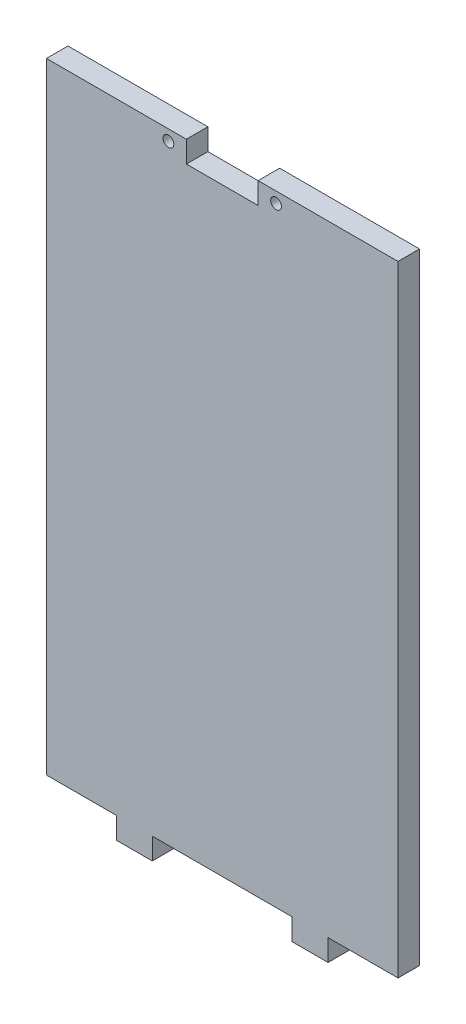
ISO-10303-21;
HEADER;
FILE_DESCRIPTION(('STEP AP214'),'2;1');
FILE_NAME('part.step','',(''),(''),'','','');
FILE_SCHEMA(('AUTOMOTIVE_DESIGN { 1 0 10303 214 1 1 1 1 }'));
ENDSEC;
DATA;
#1=APPLICATION_CONTEXT('core data for automotive mechanical design processes');
#2=APPLICATION_PROTOCOL_DEFINITION('international standard','automotive_design',2000,#1);
#3=PRODUCT_CONTEXT('',#1,'mechanical');
#4=PRODUCT('Part','Part','',(#3));
#5=PRODUCT_RELATED_PRODUCT_CATEGORY('part','',(#4));
#6=PRODUCT_DEFINITION_FORMATION('','',#4);
#7=PRODUCT_DEFINITION_CONTEXT('part definition',#1,'design');
#8=PRODUCT_DEFINITION('design','',#6,#7);
#9=PRODUCT_DEFINITION_SHAPE('','',#8);
#10=(LENGTH_UNIT() NAMED_UNIT(*) SI_UNIT(.MILLI.,.METRE.));
#11=(NAMED_UNIT(*) PLANE_ANGLE_UNIT() SI_UNIT($,.RADIAN.));
#12=(NAMED_UNIT(*) SI_UNIT($,.STERADIAN.) SOLID_ANGLE_UNIT());
#13=UNCERTAINTY_MEASURE_WITH_UNIT(LENGTH_MEASURE(1.E-05),#10,'distance_accuracy_value','');
#14=(GEOMETRIC_REPRESENTATION_CONTEXT(3) GLOBAL_UNCERTAINTY_ASSIGNED_CONTEXT((#13)) GLOBAL_UNIT_ASSIGNED_CONTEXT((#10,
#11,#12)) REPRESENTATION_CONTEXT('',''));
#15=CARTESIAN_POINT('',(0.,0.,0.));
#16=DIRECTION('',(0.,0.,1.));
#17=DIRECTION('',(1.,0.,0.));
#18=AXIS2_PLACEMENT_3D('',#15,#16,#17);
#19=CARTESIAN_POINT('',(-49.,86.4999999999999,6.));
#20=DIRECTION('',(0.,-1.,0.));
#21=DIRECTION('',(0.,0.,-1.));
#22=AXIS2_PLACEMENT_3D('',#19,#20,#21);
#23=PLANE('',#22);
#24=DIRECTION('',(-1.,0.,0.));
#25=VECTOR('',#24,1.);
#26=CARTESIAN_POINT('',(-49.,86.4999999999999,6.));
#27=LINE('',#26,#25);
#28=CARTESIAN_POINT('',(-9.99999999999997,86.4999999999999,6.));
#29=VERTEX_POINT('',#28);
#30=CARTESIAN_POINT('',(-49.,86.4999999999999,6.));
#31=VERTEX_POINT('',#30);
#32=EDGE_CURVE('E309',#29,#31,#27,.T.);
#33=ORIENTED_EDGE('',*,*,#32,.F.);
#34=DIRECTION('',(0.,0.,1.));
#35=VECTOR('',#34,1.);
#36=CARTESIAN_POINT('',(-9.99999999999997,86.4999999999999,0.));
#37=LINE('',#36,#35);
#38=CARTESIAN_POINT('',(-9.99999999999997,86.4999999999999,0.));
#39=VERTEX_POINT('',#38);
#40=EDGE_CURVE('E183',#39,#29,#37,.T.);
#41=ORIENTED_EDGE('',*,*,#40,.F.);
#42=DIRECTION('',(-1.,0.,0.));
#43=VECTOR('',#42,1.);
#44=CARTESIAN_POINT('',(-49.,86.4999999999999,0.));
#45=LINE('',#44,#43);
#46=CARTESIAN_POINT('',(-49.,86.4999999999999,0.));
#47=VERTEX_POINT('',#46);
#48=EDGE_CURVE('E174',#39,#47,#45,.T.);
#49=ORIENTED_EDGE('',*,*,#48,.T.);
#50=DIRECTION('',(0.,0.,-1.));
#51=VECTOR('',#50,1.);
#52=CARTESIAN_POINT('',(-49.,86.4999999999999,6.));
#53=LINE('',#52,#51);
#54=EDGE_CURVE('E285',#31,#47,#53,.T.);
#55=ORIENTED_EDGE('',*,*,#54,.F.);
#56=EDGE_LOOP('',(#33,#41,#49,#55));
#57=FACE_BOUND('',#56,.T.);
#58=ADVANCED_FACE('F37',(#57),#23,.F.);
#59=CARTESIAN_POINT('',(-49.,-86.5,6.));
#60=DIRECTION('',(0.,1.,0.));
#61=DIRECTION('',(0.,0.,1.));
#62=AXIS2_PLACEMENT_3D('',#59,#60,#61);
#63=PLANE('',#62);
#64=DIRECTION('',(1.,0.,0.));
#65=VECTOR('',#64,1.);
#66=CARTESIAN_POINT('',(-49.,-86.5,6.));
#67=LINE('',#66,#65);
#68=CARTESIAN_POINT('',(-19.5,-86.5,6.));
#69=VERTEX_POINT('',#68);
#70=CARTESIAN_POINT('',(19.5,-86.5,6.));
#71=VERTEX_POINT('',#70);
#72=EDGE_CURVE('E41',#69,#71,#67,.T.);
#73=ORIENTED_EDGE('',*,*,#72,.F.);
#74=DIRECTION('',(0.,0.,1.));
#75=VECTOR('',#74,1.);
#76=CARTESIAN_POINT('',(-19.5,-86.5,0.));
#77=LINE('',#76,#75);
#78=CARTESIAN_POINT('',(-19.5,-86.5,0.));
#79=VERTEX_POINT('',#78);
#80=EDGE_CURVE('E212',#79,#69,#77,.T.);
#81=ORIENTED_EDGE('',*,*,#80,.F.);
#82=DIRECTION('',(1.,0.,0.));
#83=VECTOR('',#82,1.);
#84=CARTESIAN_POINT('',(-49.,-86.5,0.));
#85=LINE('',#84,#83);
#86=CARTESIAN_POINT('',(19.5,-86.5,0.));
#87=VERTEX_POINT('',#86);
#88=EDGE_CURVE('E264',#79,#87,#85,.T.);
#89=ORIENTED_EDGE('',*,*,#88,.T.);
#90=DIRECTION('',(0.,0.,1.));
#91=VECTOR('',#90,1.);
#92=CARTESIAN_POINT('',(19.5,-86.5,0.));
#93=LINE('',#92,#91);
#94=EDGE_CURVE('E243',#87,#71,#93,.T.);
#95=ORIENTED_EDGE('',*,*,#94,.T.);
#96=EDGE_LOOP('',(#73,#81,#89,#95));
#97=FACE_BOUND('',#96,.T.);
#98=ADVANCED_FACE('F340',(#97),#63,.F.);
#99=DIRECTION('',(0.,0.,1.));
#100=VECTOR('',#99,1.);
#101=CARTESIAN_POINT('',(29.5,-86.5,0.));
#102=LINE('',#101,#100);
#103=CARTESIAN_POINT('',(29.5,-86.5,0.));
#104=VERTEX_POINT('',#103);
#105=CARTESIAN_POINT('',(29.5,-86.5,6.));
#106=VERTEX_POINT('',#105);
#107=EDGE_CURVE('E231',#104,#106,#102,.T.);
#108=ORIENTED_EDGE('',*,*,#107,.F.);
#109=CARTESIAN_POINT('',(49.,-86.5,0.));
#110=VERTEX_POINT('',#109);
#111=EDGE_CURVE('E267',#104,#110,#85,.T.);
#112=ORIENTED_EDGE('',*,*,#111,.T.);
#113=DIRECTION('',(0.,0.,-1.));
#114=VECTOR('',#113,1.);
#115=CARTESIAN_POINT('',(49.,-86.5,6.));
#116=LINE('',#115,#114);
#117=CARTESIAN_POINT('',(49.,-86.5,6.));
#118=VERTEX_POINT('',#117);
#119=EDGE_CURVE('E47',#118,#110,#116,.T.);
#120=ORIENTED_EDGE('',*,*,#119,.F.);
#121=EDGE_CURVE('E294',#106,#118,#67,.T.);
#122=ORIENTED_EDGE('',*,*,#121,.F.);
#123=EDGE_LOOP('',(#108,#112,#120,#122));
#124=FACE_BOUND('',#123,.T.);
#125=ADVANCED_FACE('F327',(#124),#63,.F.);
#126=CARTESIAN_POINT('',(-49.,86.4999999999999,6.));
#127=DIRECTION('',(1.,0.,0.));
#128=DIRECTION('',(0.,1.,0.));
#129=AXIS2_PLACEMENT_3D('',#126,#127,#128);
#130=PLANE('',#129);
#131=DIRECTION('',(0.,-1.,0.));
#132=VECTOR('',#131,1.);
#133=CARTESIAN_POINT('',(-49.,86.4999999999999,0.));
#134=LINE('',#133,#132);
#135=CARTESIAN_POINT('',(-49.,-86.5,0.));
#136=VERTEX_POINT('',#135);
#137=EDGE_CURVE('E240',#47,#136,#134,.T.);
#138=ORIENTED_EDGE('',*,*,#137,.T.);
#139=DIRECTION('',(0.,0.,-1.));
#140=VECTOR('',#139,1.);
#141=CARTESIAN_POINT('',(-49.,-86.5,6.));
#142=LINE('',#141,#140);
#143=CARTESIAN_POINT('',(-49.,-86.5,6.));
#144=VERTEX_POINT('',#143);
#145=EDGE_CURVE('E11',#144,#136,#142,.T.);
#146=ORIENTED_EDGE('',*,*,#145,.F.);
#147=DIRECTION('',(0.,-1.,0.));
#148=VECTOR('',#147,1.);
#149=CARTESIAN_POINT('',(-49.,86.4999999999999,6.));
#150=LINE('',#149,#148);
#151=EDGE_CURVE('E290',#31,#144,#150,.T.);
#152=ORIENTED_EDGE('',*,*,#151,.F.);
#153=ORIENTED_EDGE('',*,*,#54,.T.);
#154=EDGE_LOOP('',(#138,#146,#152,#153));
#155=FACE_BOUND('',#154,.T.);
#156=ADVANCED_FACE('F39',(#155),#130,.F.);
#157=CARTESIAN_POINT('',(-29.5,-86.5,0.));
#158=VERTEX_POINT('',#157);
#159=EDGE_CURVE('E266',#136,#158,#85,.T.);
#160=ORIENTED_EDGE('',*,*,#159,.T.);
#161=DIRECTION('',(0.,0.,1.));
#162=VECTOR('',#161,1.);
#163=CARTESIAN_POINT('',(-29.5,-86.5,0.));
#164=LINE('',#163,#162);
#165=CARTESIAN_POINT('',(-29.5,-86.5,6.));
#166=VERTEX_POINT('',#165);
#167=EDGE_CURVE('E225',#158,#166,#164,.T.);
#168=ORIENTED_EDGE('',*,*,#167,.T.);
#169=EDGE_CURVE('E312',#144,#166,#67,.T.);
#170=ORIENTED_EDGE('',*,*,#169,.F.);
#171=ORIENTED_EDGE('',*,*,#145,.T.);
#172=EDGE_LOOP('',(#160,#168,#170,#171));
#173=FACE_BOUND('',#172,.T.);
#174=ADVANCED_FACE('F337',(#173),#63,.F.);
#175=CARTESIAN_POINT('',(49.,86.4999999999999,6.));
#176=DIRECTION('',(-1.,0.,0.));
#177=DIRECTION('',(0.,-1.,0.));
#178=AXIS2_PLACEMENT_3D('',#175,#176,#177);
#179=PLANE('',#178);
#180=DIRECTION('',(0.,1.,0.));
#181=VECTOR('',#180,1.);
#182=CARTESIAN_POINT('',(49.,86.4999999999999,0.));
#183=LINE('',#182,#181);
#184=CARTESIAN_POINT('',(49.,86.4999999999999,0.));
#185=VERTEX_POINT('',#184);
#186=EDGE_CURVE('E272',#110,#185,#183,.T.);
#187=ORIENTED_EDGE('',*,*,#186,.T.);
#188=DIRECTION('',(0.,0.,-1.));
#189=VECTOR('',#188,1.);
#190=CARTESIAN_POINT('',(49.,86.4999999999999,6.));
#191=LINE('',#190,#189);
#192=CARTESIAN_POINT('',(49.,86.4999999999999,6.));
#193=VERTEX_POINT('',#192);
#194=EDGE_CURVE('E282',#193,#185,#191,.T.);
#195=ORIENTED_EDGE('',*,*,#194,.F.);
#196=DIRECTION('',(0.,1.,0.));
#197=VECTOR('',#196,1.);
#198=CARTESIAN_POINT('',(49.,86.4999999999999,6.));
#199=LINE('',#198,#197);
#200=EDGE_CURVE('E310',#118,#193,#199,.T.);
#201=ORIENTED_EDGE('',*,*,#200,.F.);
#202=ORIENTED_EDGE('',*,*,#119,.T.);
#203=EDGE_LOOP('',(#187,#195,#201,#202));
#204=FACE_BOUND('',#203,.T.);
#205=ADVANCED_FACE('F300',(#204),#179,.F.);
#206=CARTESIAN_POINT('',(10.,86.4999999999999,0.));
#207=VERTEX_POINT('',#206);
#208=EDGE_CURVE('E288',#185,#207,#45,.T.);
#209=ORIENTED_EDGE('',*,*,#208,.T.);
#210=DIRECTION('',(0.,0.,1.));
#211=VECTOR('',#210,1.);
#212=CARTESIAN_POINT('',(10.,86.4999999999999,0.));
#213=LINE('',#212,#211);
#214=CARTESIAN_POINT('',(10.,86.4999999999999,6.));
#215=VERTEX_POINT('',#214);
#216=EDGE_CURVE('E186',#207,#215,#213,.T.);
#217=ORIENTED_EDGE('',*,*,#216,.T.);
#218=EDGE_CURVE('E287',#193,#215,#27,.T.);
#219=ORIENTED_EDGE('',*,*,#218,.F.);
#220=ORIENTED_EDGE('',*,*,#194,.T.);
#221=EDGE_LOOP('',(#209,#217,#219,#220));
#222=FACE_BOUND('',#221,.T.);
#223=ADVANCED_FACE('F305',(#222),#23,.F.);
#224=CARTESIAN_POINT('',(0.,0.,6.));
#225=DIRECTION('',(0.,0.,1.));
#226=DIRECTION('',(1.,0.,0.));
#227=AXIS2_PLACEMENT_3D('',#224,#225,#226);
#228=PLANE('',#227);
#229=DIRECTION('',(0.,-1.,0.));
#230=VECTOR('',#229,1.);
#231=CARTESIAN_POINT('',(-9.99999999999997,86.4999999999999,6.));
#232=LINE('',#231,#230);
#233=CARTESIAN_POINT('',(-9.99999999999997,80.4999999999999,6.));
#234=VERTEX_POINT('',#233);
#235=EDGE_CURVE('E159',#29,#234,#232,.T.);
#236=ORIENTED_EDGE('',*,*,#235,.F.);
#237=ORIENTED_EDGE('',*,*,#32,.T.);
#238=ORIENTED_EDGE('',*,*,#151,.T.);
#239=ORIENTED_EDGE('',*,*,#169,.T.);
#240=DIRECTION('',(0.,-1.,0.));
#241=VECTOR('',#240,1.);
#242=CARTESIAN_POINT('',(-29.5,-86.5,6.));
#243=LINE('',#242,#241);
#244=CARTESIAN_POINT('',(-29.5,-92.5000000000001,6.));
#245=VERTEX_POINT('',#244);
#246=EDGE_CURVE('E215',#166,#245,#243,.T.);
#247=ORIENTED_EDGE('',*,*,#246,.T.);
#248=DIRECTION('',(1.,0.,0.));
#249=VECTOR('',#248,1.);
#250=CARTESIAN_POINT('',(-19.5,-92.5000000000001,6.));
#251=LINE('',#250,#249);
#252=CARTESIAN_POINT('',(-19.5,-92.5000000000001,6.));
#253=VERTEX_POINT('',#252);
#254=EDGE_CURVE('E206',#245,#253,#251,.T.);
#255=ORIENTED_EDGE('',*,*,#254,.T.);
#256=DIRECTION('',(0.,1.,0.));
#257=VECTOR('',#256,1.);
#258=CARTESIAN_POINT('',(-19.5,-86.5,6.));
#259=LINE('',#258,#257);
#260=EDGE_CURVE('E199',#253,#69,#259,.T.);
#261=ORIENTED_EDGE('',*,*,#260,.T.);
#262=ORIENTED_EDGE('',*,*,#72,.T.);
#263=DIRECTION('',(0.,-1.,0.));
#264=VECTOR('',#263,1.);
#265=CARTESIAN_POINT('',(19.5,-86.5,6.));
#266=LINE('',#265,#264);
#267=CARTESIAN_POINT('',(19.5,-92.5000000000001,6.));
#268=VERTEX_POINT('',#267);
#269=EDGE_CURVE('E237',#71,#268,#266,.T.);
#270=ORIENTED_EDGE('',*,*,#269,.T.);
#271=DIRECTION('',(1.,0.,0.));
#272=VECTOR('',#271,1.);
#273=CARTESIAN_POINT('',(29.5,-92.5000000000001,6.));
#274=LINE('',#273,#272);
#275=CARTESIAN_POINT('',(29.5,-92.5000000000001,6.));
#276=VERTEX_POINT('',#275);
#277=EDGE_CURVE('E233',#268,#276,#274,.T.);
#278=ORIENTED_EDGE('',*,*,#277,.T.);
#279=DIRECTION('',(0.,1.,0.));
#280=VECTOR('',#279,1.);
#281=CARTESIAN_POINT('',(29.5,-86.5,6.));
#282=LINE('',#281,#280);
#283=EDGE_CURVE('E222',#276,#106,#282,.T.);
#284=ORIENTED_EDGE('',*,*,#283,.T.);
#285=ORIENTED_EDGE('',*,*,#121,.T.);
#286=ORIENTED_EDGE('',*,*,#200,.T.);
#287=ORIENTED_EDGE('',*,*,#218,.T.);
#288=DIRECTION('',(0.,1.,0.));
#289=VECTOR('',#288,1.);
#290=CARTESIAN_POINT('',(10.,86.4999999999999,6.));
#291=LINE('',#290,#289);
#292=CARTESIAN_POINT('',(10.,80.4999999999999,6.));
#293=VERTEX_POINT('',#292);
#294=EDGE_CURVE('E175',#293,#215,#291,.T.);
#295=ORIENTED_EDGE('',*,*,#294,.F.);
#296=DIRECTION('',(1.,0.,0.));
#297=VECTOR('',#296,1.);
#298=CARTESIAN_POINT('',(-9.99999999999997,80.4999999999999,6.));
#299=LINE('',#298,#297);
#300=EDGE_CURVE('E177',#234,#293,#299,.T.);
#301=ORIENTED_EDGE('',*,*,#300,.F.);
#302=EDGE_LOOP('',(#236,#237,#238,#239,#247,#255,#261,#262,#270,#278,#284,#285,#286,#287,#295,#301));
#303=FACE_BOUND('',#302,.T.);
#304=CARTESIAN_POINT('',(15.,83.4999999999999,6.));
#305=DIRECTION('',(0.,0.,1.));
#306=DIRECTION('',(1.,0.,0.));
#307=AXIS2_PLACEMENT_3D('',#304,#305,#306);
#308=CIRCLE('',#307,1.5);
#309=CARTESIAN_POINT('',(16.5,83.4999999999999,6.));
#310=VERTEX_POINT('',#309);
#311=EDGE_CURVE('E185',#310,#310,#308,.T.);
#312=ORIENTED_EDGE('',*,*,#311,.F.);
#313=EDGE_LOOP('',(#312));
#314=FACE_BOUND('',#313,.T.);
#315=CARTESIAN_POINT('',(-15.,83.4999999999999,6.));
#316=DIRECTION('',(0.,0.,1.));
#317=DIRECTION('',(1.,0.,0.));
#318=AXIS2_PLACEMENT_3D('',#315,#316,#317);
#319=CIRCLE('',#318,1.5);
#320=CARTESIAN_POINT('',(-13.5,83.4999999999999,6.));
#321=VERTEX_POINT('',#320);
#322=EDGE_CURVE('E193',#321,#321,#319,.T.);
#323=ORIENTED_EDGE('',*,*,#322,.F.);
#324=EDGE_LOOP('',(#323));
#325=FACE_BOUND('',#324,.T.);
#326=ADVANCED_FACE('F322',(#303,#314,#325),#228,.T.);
#327=CARTESIAN_POINT('',(0.,0.,0.));
#328=DIRECTION('',(0.,0.,1.));
#329=DIRECTION('',(1.,0.,0.));
#330=AXIS2_PLACEMENT_3D('',#327,#328,#329);
#331=PLANE('',#330);
#332=ORIENTED_EDGE('',*,*,#48,.F.);
#333=DIRECTION('',(0.,-1.,0.));
#334=VECTOR('',#333,1.);
#335=CARTESIAN_POINT('',(-9.99999999999997,86.4999999999999,0.));
#336=LINE('',#335,#334);
#337=CARTESIAN_POINT('',(-9.99999999999997,80.4999999999999,0.));
#338=VERTEX_POINT('',#337);
#339=EDGE_CURVE('E156',#39,#338,#336,.T.);
#340=ORIENTED_EDGE('',*,*,#339,.T.);
#341=DIRECTION('',(1.,0.,0.));
#342=VECTOR('',#341,1.);
#343=CARTESIAN_POINT('',(-9.99999999999997,80.4999999999999,0.));
#344=LINE('',#343,#342);
#345=CARTESIAN_POINT('',(10.,80.4999999999999,0.));
#346=VERTEX_POINT('',#345);
#347=EDGE_CURVE('E166',#338,#346,#344,.T.);
#348=ORIENTED_EDGE('',*,*,#347,.T.);
#349=DIRECTION('',(0.,1.,0.));
#350=VECTOR('',#349,1.);
#351=CARTESIAN_POINT('',(10.,86.4999999999999,0.));
#352=LINE('',#351,#350);
#353=EDGE_CURVE('E55',#346,#207,#352,.T.);
#354=ORIENTED_EDGE('',*,*,#353,.T.);
#355=ORIENTED_EDGE('',*,*,#208,.F.);
#356=ORIENTED_EDGE('',*,*,#186,.F.);
#357=ORIENTED_EDGE('',*,*,#111,.F.);
#358=DIRECTION('',(0.,1.,0.));
#359=VECTOR('',#358,1.);
#360=CARTESIAN_POINT('',(29.5,-86.5,0.));
#361=LINE('',#360,#359);
#362=CARTESIAN_POINT('',(29.5,-92.5000000000001,0.));
#363=VERTEX_POINT('',#362);
#364=EDGE_CURVE('E236',#363,#104,#361,.T.);
#365=ORIENTED_EDGE('',*,*,#364,.F.);
#366=DIRECTION('',(1.,0.,0.));
#367=VECTOR('',#366,1.);
#368=CARTESIAN_POINT('',(29.5,-92.5000000000001,0.));
#369=LINE('',#368,#367);
#370=CARTESIAN_POINT('',(19.5,-92.5000000000001,0.));
#371=VERTEX_POINT('',#370);
#372=EDGE_CURVE('E228',#371,#363,#369,.T.);
#373=ORIENTED_EDGE('',*,*,#372,.F.);
#374=DIRECTION('',(0.,-1.,0.));
#375=VECTOR('',#374,1.);
#376=CARTESIAN_POINT('',(19.5,-86.5,0.));
#377=LINE('',#376,#375);
#378=EDGE_CURVE('E232',#87,#371,#377,.T.);
#379=ORIENTED_EDGE('',*,*,#378,.F.);
#380=ORIENTED_EDGE('',*,*,#88,.F.);
#381=DIRECTION('',(0.,1.,0.));
#382=VECTOR('',#381,1.);
#383=CARTESIAN_POINT('',(-19.5,-86.5,0.));
#384=LINE('',#383,#382);
#385=CARTESIAN_POINT('',(-19.5,-92.5000000000001,0.));
#386=VERTEX_POINT('',#385);
#387=EDGE_CURVE('E202',#386,#79,#384,.T.);
#388=ORIENTED_EDGE('',*,*,#387,.F.);
#389=DIRECTION('',(1.,0.,0.));
#390=VECTOR('',#389,1.);
#391=CARTESIAN_POINT('',(-19.5,-92.5000000000001,0.));
#392=LINE('',#391,#390);
#393=CARTESIAN_POINT('',(-29.5,-92.5000000000001,0.));
#394=VERTEX_POINT('',#393);
#395=EDGE_CURVE('E209',#394,#386,#392,.T.);
#396=ORIENTED_EDGE('',*,*,#395,.F.);
#397=DIRECTION('',(0.,-1.,0.));
#398=VECTOR('',#397,1.);
#399=CARTESIAN_POINT('',(-29.5,-86.5,0.));
#400=LINE('',#399,#398);
#401=EDGE_CURVE('E205',#158,#394,#400,.T.);
#402=ORIENTED_EDGE('',*,*,#401,.F.);
#403=ORIENTED_EDGE('',*,*,#159,.F.);
#404=ORIENTED_EDGE('',*,*,#137,.F.);
#405=EDGE_LOOP('',(#332,#340,#348,#354,#355,#356,#357,#365,#373,#379,#380,#388,#396,#402,#403,#404));
#406=FACE_BOUND('',#405,.T.);
#407=CARTESIAN_POINT('',(15.,83.4999999999999,0.));
#408=DIRECTION('',(0.,0.,1.));
#409=DIRECTION('',(1.,0.,0.));
#410=AXIS2_PLACEMENT_3D('',#407,#408,#409);
#411=CIRCLE('',#410,1.5);
#412=CARTESIAN_POINT('',(16.5,83.4999999999999,0.));
#413=VERTEX_POINT('',#412);
#414=EDGE_CURVE('E190',#413,#413,#411,.T.);
#415=ORIENTED_EDGE('',*,*,#414,.T.);
#416=EDGE_LOOP('',(#415));
#417=FACE_BOUND('',#416,.T.);
#418=CARTESIAN_POINT('',(-15.,83.4999999999999,0.));
#419=DIRECTION('',(0.,0.,1.));
#420=DIRECTION('',(1.,0.,0.));
#421=AXIS2_PLACEMENT_3D('',#418,#419,#420);
#422=CIRCLE('',#421,1.5);
#423=CARTESIAN_POINT('',(-13.5,83.4999999999999,0.));
#424=VERTEX_POINT('',#423);
#425=EDGE_CURVE('E196',#424,#424,#422,.T.);
#426=ORIENTED_EDGE('',*,*,#425,.T.);
#427=EDGE_LOOP('',(#426));
#428=FACE_BOUND('',#427,.T.);
#429=ADVANCED_FACE('F171',(#406,#417,#428),#331,.F.);
#430=CARTESIAN_POINT('',(29.5,-86.5,0.));
#431=DIRECTION('',(1.,0.,0.));
#432=DIRECTION('',(0.,0.,-1.));
#433=AXIS2_PLACEMENT_3D('',#430,#431,#432);
#434=PLANE('',#433);
#435=ORIENTED_EDGE('',*,*,#283,.F.);
#436=DIRECTION('',(0.,0.,1.));
#437=VECTOR('',#436,1.);
#438=CARTESIAN_POINT('',(29.5,-92.5000000000001,0.));
#439=LINE('',#438,#437);
#440=EDGE_CURVE('E238',#363,#276,#439,.T.);
#441=ORIENTED_EDGE('',*,*,#440,.F.);
#442=ORIENTED_EDGE('',*,*,#364,.T.);
#443=ORIENTED_EDGE('',*,*,#107,.T.);
#444=EDGE_LOOP('',(#435,#441,#442,#443));
#445=FACE_BOUND('',#444,.T.);
#446=ADVANCED_FACE('F402',(#445),#434,.T.);
#447=CARTESIAN_POINT('',(29.5,-92.5000000000001,0.));
#448=DIRECTION('',(0.,-1.,0.));
#449=DIRECTION('',(0.,0.,-1.));
#450=AXIS2_PLACEMENT_3D('',#447,#448,#449);
#451=PLANE('',#450);
#452=ORIENTED_EDGE('',*,*,#277,.F.);
#453=DIRECTION('',(0.,0.,1.));
#454=VECTOR('',#453,1.);
#455=CARTESIAN_POINT('',(19.5,-92.5000000000001,0.));
#456=LINE('',#455,#454);
#457=EDGE_CURVE('E241',#371,#268,#456,.T.);
#458=ORIENTED_EDGE('',*,*,#457,.F.);
#459=ORIENTED_EDGE('',*,*,#372,.T.);
#460=ORIENTED_EDGE('',*,*,#440,.T.);
#461=EDGE_LOOP('',(#452,#458,#459,#460));
#462=FACE_BOUND('',#461,.T.);
#463=ADVANCED_FACE('F415',(#462),#451,.T.);
#464=CARTESIAN_POINT('',(19.5,-86.5,0.));
#465=DIRECTION('',(-1.,0.,0.));
#466=DIRECTION('',(0.,-1.,0.));
#467=AXIS2_PLACEMENT_3D('',#464,#465,#466);
#468=PLANE('',#467);
#469=ORIENTED_EDGE('',*,*,#269,.F.);
#470=ORIENTED_EDGE('',*,*,#94,.F.);
#471=ORIENTED_EDGE('',*,*,#378,.T.);
#472=ORIENTED_EDGE('',*,*,#457,.T.);
#473=EDGE_LOOP('',(#469,#470,#471,#472));
#474=FACE_BOUND('',#473,.T.);
#475=ADVANCED_FACE('F424',(#474),#468,.T.);
#476=CARTESIAN_POINT('',(-19.5,-86.5,0.));
#477=DIRECTION('',(1.,0.,0.));
#478=DIRECTION('',(0.,0.,-1.));
#479=AXIS2_PLACEMENT_3D('',#476,#477,#478);
#480=PLANE('',#479);
#481=ORIENTED_EDGE('',*,*,#260,.F.);
#482=DIRECTION('',(0.,0.,1.));
#483=VECTOR('',#482,1.);
#484=CARTESIAN_POINT('',(-19.5,-92.5000000000001,0.));
#485=LINE('',#484,#483);
#486=EDGE_CURVE('E220',#386,#253,#485,.T.);
#487=ORIENTED_EDGE('',*,*,#486,.F.);
#488=ORIENTED_EDGE('',*,*,#387,.T.);
#489=ORIENTED_EDGE('',*,*,#80,.T.);
#490=EDGE_LOOP('',(#481,#487,#488,#489));
#491=FACE_BOUND('',#490,.T.);
#492=ADVANCED_FACE('F433',(#491),#480,.T.);
#493=CARTESIAN_POINT('',(-19.5,-92.5000000000001,0.));
#494=DIRECTION('',(0.,-1.,0.));
#495=DIRECTION('',(0.,0.,-1.));
#496=AXIS2_PLACEMENT_3D('',#493,#494,#495);
#497=PLANE('',#496);
#498=ORIENTED_EDGE('',*,*,#254,.F.);
#499=DIRECTION('',(0.,0.,1.));
#500=VECTOR('',#499,1.);
#501=CARTESIAN_POINT('',(-29.5,-92.5000000000001,0.));
#502=LINE('',#501,#500);
#503=EDGE_CURVE('E223',#394,#245,#502,.T.);
#504=ORIENTED_EDGE('',*,*,#503,.F.);
#505=ORIENTED_EDGE('',*,*,#395,.T.);
#506=ORIENTED_EDGE('',*,*,#486,.T.);
#507=EDGE_LOOP('',(#498,#504,#505,#506));
#508=FACE_BOUND('',#507,.T.);
#509=ADVANCED_FACE('F442',(#508),#497,.T.);
#510=CARTESIAN_POINT('',(-29.5,-86.5,0.));
#511=DIRECTION('',(-1.,0.,0.));
#512=DIRECTION('',(0.,-1.,0.));
#513=AXIS2_PLACEMENT_3D('',#510,#511,#512);
#514=PLANE('',#513);
#515=ORIENTED_EDGE('',*,*,#246,.F.);
#516=ORIENTED_EDGE('',*,*,#167,.F.);
#517=ORIENTED_EDGE('',*,*,#401,.T.);
#518=ORIENTED_EDGE('',*,*,#503,.T.);
#519=EDGE_LOOP('',(#515,#516,#517,#518));
#520=FACE_BOUND('',#519,.T.);
#521=ADVANCED_FACE('F451',(#520),#514,.T.);
#522=CARTESIAN_POINT('',(-15.,83.4999999999999,0.));
#523=DIRECTION('',(0.,0.,1.));
#524=DIRECTION('',(1.,0.,0.));
#525=AXIS2_PLACEMENT_3D('',#522,#523,#524);
#526=CYLINDRICAL_SURFACE('',#525,1.5);
#527=ORIENTED_EDGE('',*,*,#425,.F.);
#528=EDGE_LOOP('',(#527));
#529=FACE_BOUND('',#528,.T.);
#530=ORIENTED_EDGE('',*,*,#322,.T.);
#531=EDGE_LOOP('',(#530));
#532=FACE_BOUND('',#531,.T.);
#533=ADVANCED_FACE('F460',(#529,#532),#526,.F.);
#534=CARTESIAN_POINT('',(15.,83.4999999999999,0.));
#535=DIRECTION('',(0.,0.,1.));
#536=DIRECTION('',(1.,0.,0.));
#537=AXIS2_PLACEMENT_3D('',#534,#535,#536);
#538=CYLINDRICAL_SURFACE('',#537,1.5);
#539=ORIENTED_EDGE('',*,*,#414,.F.);
#540=EDGE_LOOP('',(#539));
#541=FACE_BOUND('',#540,.T.);
#542=ORIENTED_EDGE('',*,*,#311,.T.);
#543=EDGE_LOOP('',(#542));
#544=FACE_BOUND('',#543,.T.);
#545=ADVANCED_FACE('F469',(#541,#544),#538,.F.);
#546=CARTESIAN_POINT('',(-9.99999999999997,86.4999999999999,0.));
#547=DIRECTION('',(-1.,0.,0.));
#548=DIRECTION('',(0.,-1.,0.));
#549=AXIS2_PLACEMENT_3D('',#546,#547,#548);
#550=PLANE('',#549);
#551=ORIENTED_EDGE('',*,*,#235,.T.);
#552=DIRECTION('',(0.,0.,1.));
#553=VECTOR('',#552,1.);
#554=CARTESIAN_POINT('',(-9.99999999999997,80.4999999999999,0.));
#555=LINE('',#554,#553);
#556=EDGE_CURVE('E152',#338,#234,#555,.T.);
#557=ORIENTED_EDGE('',*,*,#556,.F.);
#558=ORIENTED_EDGE('',*,*,#339,.F.);
#559=ORIENTED_EDGE('',*,*,#40,.T.);
#560=EDGE_LOOP('',(#551,#557,#558,#559));
#561=FACE_BOUND('',#560,.T.);
#562=ADVANCED_FACE('F154',(#561),#550,.F.);
#563=CARTESIAN_POINT('',(10.,86.4999999999999,0.));
#564=DIRECTION('',(1.,0.,0.));
#565=DIRECTION('',(0.,1.,0.));
#566=AXIS2_PLACEMENT_3D('',#563,#564,#565);
#567=PLANE('',#566);
#568=ORIENTED_EDGE('',*,*,#294,.T.);
#569=ORIENTED_EDGE('',*,*,#216,.F.);
#570=ORIENTED_EDGE('',*,*,#353,.F.);
#571=DIRECTION('',(0.,0.,1.));
#572=VECTOR('',#571,1.);
#573=CARTESIAN_POINT('',(10.,80.4999999999999,0.));
#574=LINE('',#573,#572);
#575=EDGE_CURVE('E163',#346,#293,#574,.T.);
#576=ORIENTED_EDGE('',*,*,#575,.T.);
#577=EDGE_LOOP('',(#568,#569,#570,#576));
#578=FACE_BOUND('',#577,.T.);
#579=ADVANCED_FACE('F489',(#578),#567,.F.);
#580=CARTESIAN_POINT('',(-9.99999999999997,80.4999999999999,0.));
#581=DIRECTION('',(0.,-1.,0.));
#582=DIRECTION('',(0.,0.,-1.));
#583=AXIS2_PLACEMENT_3D('',#580,#581,#582);
#584=PLANE('',#583);
#585=ORIENTED_EDGE('',*,*,#300,.T.);
#586=ORIENTED_EDGE('',*,*,#575,.F.);
#587=ORIENTED_EDGE('',*,*,#347,.F.);
#588=ORIENTED_EDGE('',*,*,#556,.T.);
#589=EDGE_LOOP('',(#585,#586,#587,#588));
#590=FACE_BOUND('',#589,.T.);
#591=ADVANCED_FACE('F167',(#590),#584,.F.);
#592=CLOSED_SHELL('',(#58,#98,#125,#156,#174,#205,#223,#326,#429,#446,#463,#475,#492,#509,#521,
#533,#545,#562,#579,#591));
#593=MANIFOLD_SOLID_BREP('B2',#592);
#594=ADVANCED_BREP_SHAPE_REPRESENTATION('',(#18,#593),#14);
#595=SHAPE_DEFINITION_REPRESENTATION(#9,#594);
ENDSEC;
END-ISO-10303-21;
